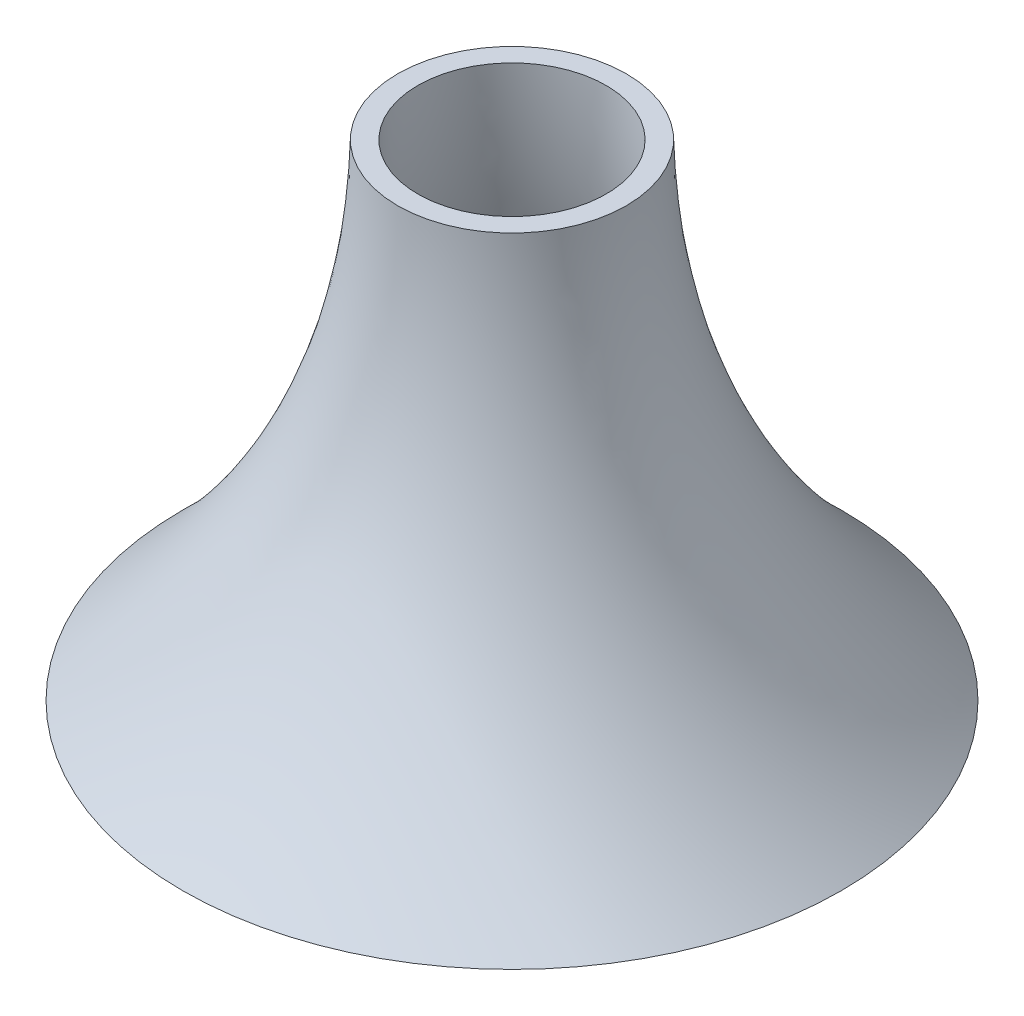
ISO-10303-21;
HEADER;
FILE_DESCRIPTION(('STEP AP214'),'2;1');
FILE_NAME('part.step','',(''),(''),'','','');
FILE_SCHEMA(('AUTOMOTIVE_DESIGN { 1 0 10303 214 1 1 1 1 }'));
ENDSEC;
DATA;
#1=APPLICATION_CONTEXT('core data for automotive mechanical design processes');
#2=APPLICATION_PROTOCOL_DEFINITION('international standard','automotive_design',2000,#1);
#3=PRODUCT_CONTEXT('',#1,'mechanical');
#4=PRODUCT('Part','Part','',(#3));
#5=PRODUCT_RELATED_PRODUCT_CATEGORY('part','',(#4));
#6=PRODUCT_DEFINITION_FORMATION('','',#4);
#7=PRODUCT_DEFINITION_CONTEXT('part definition',#1,'design');
#8=PRODUCT_DEFINITION('design','',#6,#7);
#9=PRODUCT_DEFINITION_SHAPE('','',#8);
#10=(LENGTH_UNIT() NAMED_UNIT(*) SI_UNIT(.MILLI.,.METRE.));
#11=(NAMED_UNIT(*) PLANE_ANGLE_UNIT() SI_UNIT($,.RADIAN.));
#12=(NAMED_UNIT(*) SI_UNIT($,.STERADIAN.) SOLID_ANGLE_UNIT());
#13=UNCERTAINTY_MEASURE_WITH_UNIT(LENGTH_MEASURE(1.E-05),#10,'distance_accuracy_value','');
#14=(GEOMETRIC_REPRESENTATION_CONTEXT(3) GLOBAL_UNCERTAINTY_ASSIGNED_CONTEXT((#13)) GLOBAL_UNIT_ASSIGNED_CONTEXT((#10,
#11,#12)) REPRESENTATION_CONTEXT('',''));
#15=CARTESIAN_POINT('',(0.,0.,0.));
#16=DIRECTION('',(0.,0.,1.));
#17=DIRECTION('',(1.,0.,0.));
#18=AXIS2_PLACEMENT_3D('',#15,#16,#17);
#19=CARTESIAN_POINT('',(35.,98.4039462195902,0.));
#20=CARTESIAN_POINT('',(37.5833959150921,-8.43095742020656,0.));
#21=CARTESIAN_POINT('',(114.998890747709,-82.1011545589525,0.));
#22=B_SPLINE_CURVE_WITH_KNOTS('',2,(#19,#20,#21),.UNSPECIFIED.,.F.,.F.,(3,3),(0.,1.),.UNSPECIFIED.);
#23=CARTESIAN_POINT('',(0.,105.448040776767,0.));
#24=DIRECTION('',(0.,1.,0.));
#25=AXIS1_PLACEMENT('',#23,#24);
#26=SURFACE_OF_REVOLUTION('',#22,#25);
#27=CARTESIAN_POINT('',(0.,-82.1011545589526,0.));
#28=DIRECTION('',(0.,1.,0.));
#29=DIRECTION('',(-1.,0.,0.));
#30=AXIS2_PLACEMENT_3D('',#27,#28,#29);
#31=CIRCLE('',#30,114.998890747709);
#32=CARTESIAN_POINT('',(-114.998890747709,-82.1011545589526,0.));
#33=VERTEX_POINT('',#32);
#34=EDGE_CURVE('E50',#33,#33,#31,.T.);
#35=ORIENTED_EDGE('',*,*,#34,.F.);
#36=EDGE_LOOP('',(#35));
#37=FACE_BOUND('',#36,.T.);
#38=CARTESIAN_POINT('',(0.,98.4039462195902,0.));
#39=DIRECTION('',(0.,1.,0.));
#40=DIRECTION('',(-1.,0.,0.));
#41=AXIS2_PLACEMENT_3D('',#38,#39,#40);
#42=CIRCLE('',#41,35.);
#43=CARTESIAN_POINT('',(-35.,98.4039462195902,0.));
#44=VERTEX_POINT('',#43);
#45=EDGE_CURVE('E10',#44,#44,#42,.T.);
#46=ORIENTED_EDGE('',*,*,#45,.T.);
#47=EDGE_LOOP('',(#46));
#48=FACE_BOUND('',#47,.T.);
#49=ADVANCED_FACE('F35',(#37,#48),#26,.T.);
#50=CARTESIAN_POINT('',(35.,98.4039462195902,0.));
#51=DIRECTION('',(0.,-1.,0.));
#52=DIRECTION('',(1.,0.,0.));
#53=AXIS2_PLACEMENT_3D('',#50,#51,#52);
#54=PLANE('',#53);
#55=ORIENTED_EDGE('',*,*,#45,.F.);
#56=EDGE_LOOP('',(#55));
#57=FACE_BOUND('',#56,.T.);
#58=CARTESIAN_POINT('',(0.,98.4039462195902,0.));
#59=DIRECTION('',(0.,1.,0.));
#60=DIRECTION('',(-1.,0.,0.));
#61=AXIS2_PLACEMENT_3D('',#58,#59,#60);
#62=CIRCLE('',#61,42.5);
#63=CARTESIAN_POINT('',(-42.5,98.4039462195902,0.));
#64=VERTEX_POINT('',#63);
#65=EDGE_CURVE('E42',#64,#64,#62,.T.);
#66=ORIENTED_EDGE('',*,*,#65,.T.);
#67=EDGE_LOOP('',(#66));
#68=FACE_BOUND('',#67,.T.);
#69=ADVANCED_FACE('F69',(#57,#68),#54,.F.);
#70=CARTESIAN_POINT('',(122.498890747709,-82.1011545589525,0.));
#71=CARTESIAN_POINT('',(45.0833959150921,-8.43095742020649,0.));
#72=CARTESIAN_POINT('',(42.5,98.4039462195902,0.));
#73=B_SPLINE_CURVE_WITH_KNOTS('',2,(#70,#71,#72),.UNSPECIFIED.,.F.,.F.,(3,3),(0.,1.),.UNSPECIFIED.);
#74=CARTESIAN_POINT('',(0.,105.448040776767,0.));
#75=DIRECTION('',(0.,1.,0.));
#76=AXIS1_PLACEMENT('',#74,#75);
#77=SURFACE_OF_REVOLUTION('',#73,#76);
#78=ORIENTED_EDGE('',*,*,#65,.F.);
#79=EDGE_LOOP('',(#78));
#80=FACE_BOUND('',#79,.T.);
#81=CARTESIAN_POINT('',(0.,-82.1011545589526,0.));
#82=DIRECTION('',(0.,1.,0.));
#83=DIRECTION('',(-1.,0.,0.));
#84=AXIS2_PLACEMENT_3D('',#81,#82,#83);
#85=CIRCLE('',#84,122.498890747709);
#86=CARTESIAN_POINT('',(-122.498890747709,-82.1011545589526,0.));
#87=VERTEX_POINT('',#86);
#88=EDGE_CURVE('E46',#87,#87,#85,.T.);
#89=ORIENTED_EDGE('',*,*,#88,.T.);
#90=EDGE_LOOP('',(#89));
#91=FACE_BOUND('',#90,.T.);
#92=ADVANCED_FACE('F65',(#80,#91),#77,.T.);
#93=CARTESIAN_POINT('',(114.998890747709,-82.1011545589525,0.));
#94=DIRECTION('',(0.,1.,0.));
#95=DIRECTION('',(-1.,0.,0.));
#96=AXIS2_PLACEMENT_3D('',#93,#94,#95);
#97=PLANE('',#96);
#98=ORIENTED_EDGE('',*,*,#88,.F.);
#99=EDGE_LOOP('',(#98));
#100=FACE_BOUND('',#99,.T.);
#101=ORIENTED_EDGE('',*,*,#34,.T.);
#102=EDGE_LOOP('',(#101));
#103=FACE_BOUND('',#102,.T.);
#104=ADVANCED_FACE('F68',(#100,#103),#97,.F.);
#105=CLOSED_SHELL('',(#49,#69,#92,#104));
#106=MANIFOLD_SOLID_BREP('B2',#105);
#107=ADVANCED_BREP_SHAPE_REPRESENTATION('',(#18,#106),#14);
#108=SHAPE_DEFINITION_REPRESENTATION(#9,#107);
ENDSEC;
END-ISO-10303-21;
